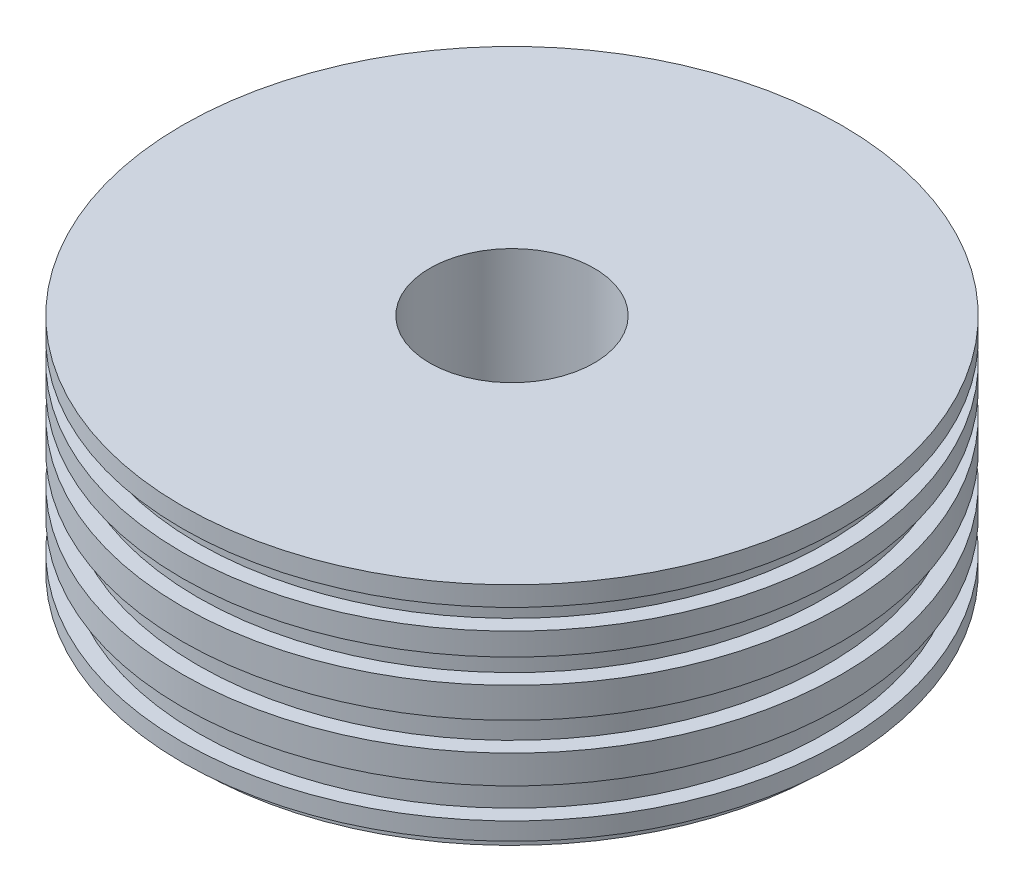
ISO-10303-21;
HEADER;
FILE_DESCRIPTION(('STEP AP214'),'2;1');
FILE_NAME('part.step','',(''),(''),'','','');
FILE_SCHEMA(('AUTOMOTIVE_DESIGN { 1 0 10303 214 1 1 1 1 }'));
ENDSEC;
DATA;
#1=APPLICATION_CONTEXT('core data for automotive mechanical design processes');
#2=APPLICATION_PROTOCOL_DEFINITION('international standard','automotive_design',2000,#1);
#3=PRODUCT_CONTEXT('',#1,'mechanical');
#4=PRODUCT('Part','Part','',(#3));
#5=PRODUCT_RELATED_PRODUCT_CATEGORY('part','',(#4));
#6=PRODUCT_DEFINITION_FORMATION('','',#4);
#7=PRODUCT_DEFINITION_CONTEXT('part definition',#1,'design');
#8=PRODUCT_DEFINITION('design','',#6,#7);
#9=PRODUCT_DEFINITION_SHAPE('','',#8);
#10=(LENGTH_UNIT() NAMED_UNIT(*) SI_UNIT(.MILLI.,.METRE.));
#11=(NAMED_UNIT(*) PLANE_ANGLE_UNIT() SI_UNIT($,.RADIAN.));
#12=(NAMED_UNIT(*) SI_UNIT($,.STERADIAN.) SOLID_ANGLE_UNIT());
#13=UNCERTAINTY_MEASURE_WITH_UNIT(LENGTH_MEASURE(1.E-05),#10,'distance_accuracy_value','');
#14=(GEOMETRIC_REPRESENTATION_CONTEXT(3) GLOBAL_UNCERTAINTY_ASSIGNED_CONTEXT((#13)) GLOBAL_UNIT_ASSIGNED_CONTEXT((#10,
#11,#12)) REPRESENTATION_CONTEXT('',''));
#15=CARTESIAN_POINT('',(0.,0.,0.));
#16=DIRECTION('',(0.,0.,1.));
#17=DIRECTION('',(1.,0.,0.));
#18=AXIS2_PLACEMENT_3D('',#15,#16,#17);
#19=CARTESIAN_POINT('',(0.,53.5469233178621,0.));
#20=DIRECTION('',(0.,1.,0.));
#21=DIRECTION('',(0.,0.,1.));
#22=AXIS2_PLACEMENT_3D('',#19,#20,#21);
#23=CYLINDRICAL_SURFACE('',#22,40.3402830376719);
#24=CARTESIAN_POINT('',(0.,-53.0666818531279,0.));
#25=DIRECTION('',(0.,1.,0.));
#26=DIRECTION('',(0.,0.,1.));
#27=AXIS2_PLACEMENT_3D('',#24,#25,#26);
#28=CIRCLE('',#27,40.3402830376719);
#29=CARTESIAN_POINT('',(0.,-53.0666818531279,40.3402830376719));
#30=VERTEX_POINT('',#29);
#31=EDGE_CURVE('E10',#30,#30,#28,.T.);
#32=ORIENTED_EDGE('',*,*,#31,.F.);
#33=EDGE_LOOP('',(#32));
#34=FACE_BOUND('',#33,.T.);
#35=CARTESIAN_POINT('',(0.,63.1517526125459,0.));
#36=DIRECTION('',(0.,1.,0.));
#37=DIRECTION('',(0.,0.,1.));
#38=AXIS2_PLACEMENT_3D('',#35,#36,#37);
#39=CIRCLE('',#38,40.3402830376719);
#40=CARTESIAN_POINT('',(0.,63.1517526125459,40.3402830376719));
#41=VERTEX_POINT('',#40);
#42=EDGE_CURVE('E101',#41,#41,#39,.T.);
#43=ORIENTED_EDGE('',*,*,#42,.T.);
#44=EDGE_LOOP('',(#43));
#45=FACE_BOUND('',#44,.T.);
#46=ADVANCED_FACE('F31',(#34,#45),#23,.F.);
#47=CARTESIAN_POINT('',(40.3402830376719,-53.0666818531279,0.));
#48=DIRECTION('',(0.,1.,0.));
#49=DIRECTION('',(0.,0.,1.));
#50=AXIS2_PLACEMENT_3D('',#47,#48,#49);
#51=PLANE('',#50);
#52=CARTESIAN_POINT('',(0.,-53.0666818531279,0.));
#53=DIRECTION('',(0.,1.,0.));
#54=DIRECTION('',(0.,0.,1.));
#55=AXIS2_PLACEMENT_3D('',#52,#53,#54);
#56=CIRCLE('',#55,154.157510179675);
#57=CARTESIAN_POINT('',(0.,-53.0666818531279,154.157510179675));
#58=VERTEX_POINT('',#57);
#59=EDGE_CURVE('E37',#58,#58,#56,.T.);
#60=ORIENTED_EDGE('',*,*,#59,.F.);
#61=EDGE_LOOP('',(#60));
#62=FACE_BOUND('',#61,.T.);
#63=ORIENTED_EDGE('',*,*,#31,.T.);
#64=EDGE_LOOP('',(#63));
#65=FACE_BOUND('',#64,.T.);
#66=ADVANCED_FACE('F222',(#62,#65),#51,.F.);
#67=CARTESIAN_POINT('',(0.,53.5469233178621,0.));
#68=DIRECTION('',(0.,1.,0.));
#69=DIRECTION('',(0.,0.,1.));
#70=AXIS2_PLACEMENT_3D('',#67,#68,#69);
#71=CYLINDRICAL_SURFACE('',#70,154.157510179675);
#72=CARTESIAN_POINT('',(0.,-45.8630598821151,0.));
#73=DIRECTION('',(0.,1.,0.));
#74=DIRECTION('',(0.,0.,1.));
#75=AXIS2_PLACEMENT_3D('',#72,#73,#74);
#76=CIRCLE('',#75,154.157510179675);
#77=CARTESIAN_POINT('',(0.,-45.8630598821151,154.157510179675));
#78=VERTEX_POINT('',#77);
#79=EDGE_CURVE('E41',#78,#78,#76,.T.);
#80=ORIENTED_EDGE('',*,*,#79,.F.);
#81=EDGE_LOOP('',(#80));
#82=FACE_BOUND('',#81,.T.);
#83=ORIENTED_EDGE('',*,*,#59,.T.);
#84=EDGE_LOOP('',(#83));
#85=FACE_BOUND('',#84,.T.);
#86=ADVANCED_FACE('F217',(#82,#85),#71,.T.);
#87=CARTESIAN_POINT('',(154.157510179675,-45.8630598821151,0.));
#88=DIRECTION('',(0.,1.,0.));
#89=DIRECTION('',(0.,0.,1.));
#90=AXIS2_PLACEMENT_3D('',#87,#88,#89);
#91=PLANE('',#90);
#92=CARTESIAN_POINT('',(0.,-45.8630598821151,0.));
#93=DIRECTION('',(0.,1.,0.));
#94=DIRECTION('',(0.,0.,1.));
#95=AXIS2_PLACEMENT_3D('',#92,#93,#94);
#96=CIRCLE('',#95,161.841373615422);
#97=CARTESIAN_POINT('',(0.,-45.8630598821151,161.841373615422));
#98=VERTEX_POINT('',#97);
#99=EDGE_CURVE('E45',#98,#98,#96,.T.);
#100=ORIENTED_EDGE('',*,*,#99,.F.);
#101=EDGE_LOOP('',(#100));
#102=FACE_BOUND('',#101,.T.);
#103=ORIENTED_EDGE('',*,*,#79,.T.);
#104=EDGE_LOOP('',(#103));
#105=FACE_BOUND('',#104,.T.);
#106=ADVANCED_FACE('F211',(#102,#105),#91,.F.);
#107=CARTESIAN_POINT('',(0.,53.5469233178621,0.));
#108=DIRECTION('',(0.,1.,0.));
#109=DIRECTION('',(0.,0.,1.));
#110=AXIS2_PLACEMENT_3D('',#107,#108,#109);
#111=CYLINDRICAL_SURFACE('',#110,161.841373615422);
#112=CARTESIAN_POINT('',(0.,-37.2187135168997,0.));
#113=DIRECTION('',(0.,1.,0.));
#114=DIRECTION('',(0.,0.,1.));
#115=AXIS2_PLACEMENT_3D('',#112,#113,#114);
#116=CIRCLE('',#115,161.841373615422);
#117=CARTESIAN_POINT('',(0.,-37.2187135168997,161.841373615422));
#118=VERTEX_POINT('',#117);
#119=EDGE_CURVE('E50',#118,#118,#116,.T.);
#120=ORIENTED_EDGE('',*,*,#119,.F.);
#121=EDGE_LOOP('',(#120));
#122=FACE_BOUND('',#121,.T.);
#123=ORIENTED_EDGE('',*,*,#99,.T.);
#124=EDGE_LOOP('',(#123));
#125=FACE_BOUND('',#124,.T.);
#126=ADVANCED_FACE('F205',(#122,#125),#111,.T.);
#127=CARTESIAN_POINT('',(161.841373615422,-37.2187135168997,0.));
#128=DIRECTION('',(0.,-1.,0.));
#129=DIRECTION('',(0.,0.,-1.));
#130=AXIS2_PLACEMENT_3D('',#127,#128,#129);
#131=PLANE('',#130);
#132=CARTESIAN_POINT('',(0.,-37.2187135168997,0.));
#133=DIRECTION('',(0.,1.,0.));
#134=DIRECTION('',(0.,0.,1.));
#135=AXIS2_PLACEMENT_3D('',#132,#133,#134);
#136=CIRCLE('',#135,154.157510179675);
#137=CARTESIAN_POINT('',(0.,-37.2187135168997,154.157510179675));
#138=VERTEX_POINT('',#137);
#139=EDGE_CURVE('E53',#138,#138,#136,.T.);
#140=ORIENTED_EDGE('',*,*,#139,.F.);
#141=EDGE_LOOP('',(#140));
#142=FACE_BOUND('',#141,.T.);
#143=ORIENTED_EDGE('',*,*,#119,.T.);
#144=EDGE_LOOP('',(#143));
#145=FACE_BOUND('',#144,.T.);
#146=ADVANCED_FACE('F199',(#142,#145),#131,.F.);
#147=CARTESIAN_POINT('',(0.,53.5469233178621,0.));
#148=DIRECTION('',(0.,1.,0.));
#149=DIRECTION('',(0.,0.,1.));
#150=AXIS2_PLACEMENT_3D('',#147,#148,#149);
#151=CYLINDRICAL_SURFACE('',#150,154.157510179675);
#152=CARTESIAN_POINT('',(0.,-22.3312281101398,0.));
#153=DIRECTION('',(0.,1.,0.));
#154=DIRECTION('',(0.,0.,1.));
#155=AXIS2_PLACEMENT_3D('',#152,#153,#154);
#156=CIRCLE('',#155,154.157510179675);
#157=CARTESIAN_POINT('',(0.,-22.3312281101398,154.157510179675));
#158=VERTEX_POINT('',#157);
#159=EDGE_CURVE('E56',#158,#158,#156,.T.);
#160=ORIENTED_EDGE('',*,*,#159,.F.);
#161=EDGE_LOOP('',(#160));
#162=FACE_BOUND('',#161,.T.);
#163=ORIENTED_EDGE('',*,*,#139,.T.);
#164=EDGE_LOOP('',(#163));
#165=FACE_BOUND('',#164,.T.);
#166=ADVANCED_FACE('F193',(#162,#165),#151,.T.);
#167=CARTESIAN_POINT('',(154.157510179675,-22.3312281101398,0.));
#168=DIRECTION('',(0.,1.,0.));
#169=DIRECTION('',(0.,0.,1.));
#170=AXIS2_PLACEMENT_3D('',#167,#168,#169);
#171=PLANE('',#170);
#172=CARTESIAN_POINT('',(0.,-22.3312281101398,0.));
#173=DIRECTION('',(0.,1.,0.));
#174=DIRECTION('',(0.,0.,1.));
#175=AXIS2_PLACEMENT_3D('',#172,#173,#174);
#176=CIRCLE('',#175,161.841373615422);
#177=CARTESIAN_POINT('',(0.,-22.3312281101398,161.841373615422));
#178=VERTEX_POINT('',#177);
#179=EDGE_CURVE('E59',#178,#178,#176,.T.);
#180=ORIENTED_EDGE('',*,*,#179,.F.);
#181=EDGE_LOOP('',(#180));
#182=FACE_BOUND('',#181,.T.);
#183=ORIENTED_EDGE('',*,*,#159,.T.);
#184=EDGE_LOOP('',(#183));
#185=FACE_BOUND('',#184,.T.);
#186=ADVANCED_FACE('F187',(#182,#185),#171,.F.);
#187=CARTESIAN_POINT('',(0.,53.5469233178621,0.));
#188=DIRECTION('',(0.,1.,0.));
#189=DIRECTION('',(0.,0.,1.));
#190=AXIS2_PLACEMENT_3D('',#187,#188,#189);
#191=CYLINDRICAL_SURFACE('',#190,161.841373615422);
#192=CARTESIAN_POINT('',(0.,-8.40422563284832,0.));
#193=DIRECTION('',(0.,1.,0.));
#194=DIRECTION('',(0.,0.,1.));
#195=AXIS2_PLACEMENT_3D('',#192,#193,#194);
#196=CIRCLE('',#195,161.841373615422);
#197=CARTESIAN_POINT('',(0.,-8.40422563284832,161.841373615422));
#198=VERTEX_POINT('',#197);
#199=EDGE_CURVE('E62',#198,#198,#196,.T.);
#200=ORIENTED_EDGE('',*,*,#199,.F.);
#201=EDGE_LOOP('',(#200));
#202=FACE_BOUND('',#201,.T.);
#203=ORIENTED_EDGE('',*,*,#179,.T.);
#204=EDGE_LOOP('',(#203));
#205=FACE_BOUND('',#204,.T.);
#206=ADVANCED_FACE('F181',(#202,#205),#191,.T.);
#207=CARTESIAN_POINT('',(161.841373615422,-8.40422563284832,0.));
#208=DIRECTION('',(0.,-1.,0.));
#209=DIRECTION('',(0.,0.,-1.));
#210=AXIS2_PLACEMENT_3D('',#207,#208,#209);
#211=PLANE('',#210);
#212=CARTESIAN_POINT('',(0.,-8.40422563284832,0.));
#213=DIRECTION('',(0.,1.,0.));
#214=DIRECTION('',(0.,0.,1.));
#215=AXIS2_PLACEMENT_3D('',#212,#213,#214);
#216=CIRCLE('',#215,154.157510179675);
#217=CARTESIAN_POINT('',(0.,-8.40422563284832,154.157510179675));
#218=VERTEX_POINT('',#217);
#219=EDGE_CURVE('E65',#218,#218,#216,.T.);
#220=ORIENTED_EDGE('',*,*,#219,.F.);
#221=EDGE_LOOP('',(#220));
#222=FACE_BOUND('',#221,.T.);
#223=ORIENTED_EDGE('',*,*,#199,.T.);
#224=EDGE_LOOP('',(#223));
#225=FACE_BOUND('',#224,.T.);
#226=ADVANCED_FACE('F175',(#222,#225),#211,.F.);
#227=CARTESIAN_POINT('',(0.,53.5469233178621,0.));
#228=DIRECTION('',(0.,1.,0.));
#229=DIRECTION('',(0.,0.,1.));
#230=AXIS2_PLACEMENT_3D('',#227,#228,#229);
#231=CYLINDRICAL_SURFACE('',#230,154.157510179675);
#232=CARTESIAN_POINT('',(0.,5.52277684444318,0.));
#233=DIRECTION('',(0.,1.,0.));
#234=DIRECTION('',(0.,0.,1.));
#235=AXIS2_PLACEMENT_3D('',#232,#233,#234);
#236=CIRCLE('',#235,154.157510179675);
#237=CARTESIAN_POINT('',(0.,5.52277684444318,154.157510179675));
#238=VERTEX_POINT('',#237);
#239=EDGE_CURVE('E68',#238,#238,#236,.T.);
#240=ORIENTED_EDGE('',*,*,#239,.F.);
#241=EDGE_LOOP('',(#240));
#242=FACE_BOUND('',#241,.T.);
#243=ORIENTED_EDGE('',*,*,#219,.T.);
#244=EDGE_LOOP('',(#243));
#245=FACE_BOUND('',#244,.T.);
#246=ADVANCED_FACE('F169',(#242,#245),#231,.T.);
#247=CARTESIAN_POINT('',(154.157510179675,5.52277684444318,0.));
#248=DIRECTION('',(0.,1.,0.));
#249=DIRECTION('',(0.,0.,1.));
#250=AXIS2_PLACEMENT_3D('',#247,#248,#249);
#251=PLANE('',#250);
#252=CARTESIAN_POINT('',(0.,5.52277684444318,0.));
#253=DIRECTION('',(0.,1.,0.));
#254=DIRECTION('',(0.,0.,1.));
#255=AXIS2_PLACEMENT_3D('',#252,#253,#254);
#256=CIRCLE('',#255,161.841373615422);
#257=CARTESIAN_POINT('',(0.,5.52277684444318,161.841373615422));
#258=VERTEX_POINT('',#257);
#259=EDGE_CURVE('E71',#258,#258,#256,.T.);
#260=ORIENTED_EDGE('',*,*,#259,.F.);
#261=EDGE_LOOP('',(#260));
#262=FACE_BOUND('',#261,.T.);
#263=ORIENTED_EDGE('',*,*,#239,.T.);
#264=EDGE_LOOP('',(#263));
#265=FACE_BOUND('',#264,.T.);
#266=ADVANCED_FACE('F163',(#262,#265),#251,.F.);
#267=CARTESIAN_POINT('',(0.,53.5469233178621,0.));
#268=DIRECTION('',(0.,1.,0.));
#269=DIRECTION('',(0.,0.,1.));
#270=AXIS2_PLACEMENT_3D('',#267,#268,#269);
#271=CYLINDRICAL_SURFACE('',#270,161.841373615422);
#272=CARTESIAN_POINT('',(0.,20.4102622512031,0.));
#273=DIRECTION('',(0.,1.,0.));
#274=DIRECTION('',(0.,0.,1.));
#275=AXIS2_PLACEMENT_3D('',#272,#273,#274);
#276=CIRCLE('',#275,161.841373615422);
#277=CARTESIAN_POINT('',(0.,20.4102622512031,161.841373615422));
#278=VERTEX_POINT('',#277);
#279=EDGE_CURVE('E74',#278,#278,#276,.T.);
#280=ORIENTED_EDGE('',*,*,#279,.F.);
#281=EDGE_LOOP('',(#280));
#282=FACE_BOUND('',#281,.T.);
#283=ORIENTED_EDGE('',*,*,#259,.T.);
#284=EDGE_LOOP('',(#283));
#285=FACE_BOUND('',#284,.T.);
#286=ADVANCED_FACE('F157',(#282,#285),#271,.T.);
#287=CARTESIAN_POINT('',(161.841373615422,20.4102622512031,0.));
#288=DIRECTION('',(0.,-1.,0.));
#289=DIRECTION('',(0.,0.,-1.));
#290=AXIS2_PLACEMENT_3D('',#287,#288,#289);
#291=PLANE('',#290);
#292=CARTESIAN_POINT('',(0.,20.4102622512031,0.));
#293=DIRECTION('',(0.,1.,0.));
#294=DIRECTION('',(0.,0.,1.));
#295=AXIS2_PLACEMENT_3D('',#292,#293,#294);
#296=CIRCLE('',#295,154.157510179675);
#297=CARTESIAN_POINT('',(0.,20.4102622512031,154.157510179675));
#298=VERTEX_POINT('',#297);
#299=EDGE_CURVE('E77',#298,#298,#296,.T.);
#300=ORIENTED_EDGE('',*,*,#299,.F.);
#301=EDGE_LOOP('',(#300));
#302=FACE_BOUND('',#301,.T.);
#303=ORIENTED_EDGE('',*,*,#279,.T.);
#304=EDGE_LOOP('',(#303));
#305=FACE_BOUND('',#304,.T.);
#306=ADVANCED_FACE('F151',(#302,#305),#291,.F.);
#307=CARTESIAN_POINT('',(0.,53.5469233178621,0.));
#308=DIRECTION('',(0.,1.,0.));
#309=DIRECTION('',(0.,0.,1.));
#310=AXIS2_PLACEMENT_3D('',#307,#308,#309);
#311=CYLINDRICAL_SURFACE('',#310,154.157510179675);
#312=CARTESIAN_POINT('',(0.,32.4162988695578,0.));
#313=DIRECTION('',(0.,1.,0.));
#314=DIRECTION('',(0.,0.,1.));
#315=AXIS2_PLACEMENT_3D('',#312,#313,#314);
#316=CIRCLE('',#315,154.157510179675);
#317=CARTESIAN_POINT('',(0.,32.4162988695578,154.157510179675));
#318=VERTEX_POINT('',#317);
#319=EDGE_CURVE('E80',#318,#318,#316,.T.);
#320=ORIENTED_EDGE('',*,*,#319,.F.);
#321=EDGE_LOOP('',(#320));
#322=FACE_BOUND('',#321,.T.);
#323=ORIENTED_EDGE('',*,*,#299,.T.);
#324=EDGE_LOOP('',(#323));
#325=FACE_BOUND('',#324,.T.);
#326=ADVANCED_FACE('F145',(#322,#325),#311,.T.);
#327=CARTESIAN_POINT('',(154.157510179675,32.4162988695578,0.));
#328=DIRECTION('',(0.,1.,0.));
#329=DIRECTION('',(0.,0.,1.));
#330=AXIS2_PLACEMENT_3D('',#327,#328,#329);
#331=PLANE('',#330);
#332=CARTESIAN_POINT('',(0.,32.4162988695578,0.));
#333=DIRECTION('',(0.,1.,0.));
#334=DIRECTION('',(0.,0.,1.));
#335=AXIS2_PLACEMENT_3D('',#332,#333,#334);
#336=CIRCLE('',#335,161.841373615422);
#337=CARTESIAN_POINT('',(0.,32.4162988695578,161.841373615422));
#338=VERTEX_POINT('',#337);
#339=EDGE_CURVE('E83',#338,#338,#336,.T.);
#340=ORIENTED_EDGE('',*,*,#339,.F.);
#341=EDGE_LOOP('',(#340));
#342=FACE_BOUND('',#341,.T.);
#343=ORIENTED_EDGE('',*,*,#319,.T.);
#344=EDGE_LOOP('',(#343));
#345=FACE_BOUND('',#344,.T.);
#346=ADVANCED_FACE('F139',(#342,#345),#331,.F.);
#347=CARTESIAN_POINT('',(0.,53.5469233178621,0.));
#348=DIRECTION('',(0.,1.,0.));
#349=DIRECTION('',(0.,0.,1.));
#350=AXIS2_PLACEMENT_3D('',#347,#348,#349);
#351=CYLINDRICAL_SURFACE('',#350,161.841373615422);
#352=CARTESIAN_POINT('',(0.,43.4618525584441,0.));
#353=DIRECTION('',(0.,1.,0.));
#354=DIRECTION('',(0.,0.,1.));
#355=AXIS2_PLACEMENT_3D('',#352,#353,#354);
#356=CIRCLE('',#355,161.841373615422);
#357=CARTESIAN_POINT('',(0.,43.4618525584441,161.841373615422));
#358=VERTEX_POINT('',#357);
#359=EDGE_CURVE('E86',#358,#358,#356,.T.);
#360=ORIENTED_EDGE('',*,*,#359,.F.);
#361=EDGE_LOOP('',(#360));
#362=FACE_BOUND('',#361,.T.);
#363=ORIENTED_EDGE('',*,*,#339,.T.);
#364=EDGE_LOOP('',(#363));
#365=FACE_BOUND('',#364,.T.);
#366=ADVANCED_FACE('F133',(#362,#365),#351,.T.);
#367=CARTESIAN_POINT('',(161.841373615422,43.4618525584441,0.));
#368=DIRECTION('',(0.,-1.,0.));
#369=DIRECTION('',(0.,0.,-1.));
#370=AXIS2_PLACEMENT_3D('',#367,#368,#369);
#371=PLANE('',#370);
#372=CARTESIAN_POINT('',(0.,43.4618525584441,0.));
#373=DIRECTION('',(0.,1.,0.));
#374=DIRECTION('',(0.,0.,1.));
#375=AXIS2_PLACEMENT_3D('',#372,#373,#374);
#376=CIRCLE('',#375,154.157510179675);
#377=CARTESIAN_POINT('',(0.,43.4618525584441,154.157510179675));
#378=VERTEX_POINT('',#377);
#379=EDGE_CURVE('E89',#378,#378,#376,.T.);
#380=ORIENTED_EDGE('',*,*,#379,.F.);
#381=EDGE_LOOP('',(#380));
#382=FACE_BOUND('',#381,.T.);
#383=ORIENTED_EDGE('',*,*,#359,.T.);
#384=EDGE_LOOP('',(#383));
#385=FACE_BOUND('',#384,.T.);
#386=ADVANCED_FACE('F127',(#382,#385),#371,.F.);
#387=CARTESIAN_POINT('',(0.,53.5469233178621,0.));
#388=DIRECTION('',(0.,1.,0.));
#389=DIRECTION('',(0.,0.,1.));
#390=AXIS2_PLACEMENT_3D('',#387,#388,#389);
#391=CYLINDRICAL_SURFACE('',#390,154.157510179675);
#392=CARTESIAN_POINT('',(0.,53.5469233178621,0.));
#393=DIRECTION('',(0.,1.,0.));
#394=DIRECTION('',(0.,0.,1.));
#395=AXIS2_PLACEMENT_3D('',#392,#393,#394);
#396=CIRCLE('',#395,154.157510179675);
#397=CARTESIAN_POINT('',(0.,53.5469233178621,154.157510179675));
#398=VERTEX_POINT('',#397);
#399=EDGE_CURVE('E92',#398,#398,#396,.T.);
#400=ORIENTED_EDGE('',*,*,#399,.F.);
#401=EDGE_LOOP('',(#400));
#402=FACE_BOUND('',#401,.T.);
#403=ORIENTED_EDGE('',*,*,#379,.T.);
#404=EDGE_LOOP('',(#403));
#405=FACE_BOUND('',#404,.T.);
#406=ADVANCED_FACE('F121',(#402,#405),#391,.T.);
#407=CARTESIAN_POINT('',(154.157510179675,53.5469233178621,0.));
#408=DIRECTION('',(0.,1.,0.));
#409=DIRECTION('',(0.,0.,1.));
#410=AXIS2_PLACEMENT_3D('',#407,#408,#409);
#411=PLANE('',#410);
#412=CARTESIAN_POINT('',(0.,53.5469233178621,0.));
#413=DIRECTION('',(0.,1.,0.));
#414=DIRECTION('',(0.,0.,1.));
#415=AXIS2_PLACEMENT_3D('',#412,#413,#414);
#416=CIRCLE('',#415,161.841373615422);
#417=CARTESIAN_POINT('',(0.,53.5469233178621,161.841373615422));
#418=VERTEX_POINT('',#417);
#419=EDGE_CURVE('E95',#418,#418,#416,.T.);
#420=ORIENTED_EDGE('',*,*,#419,.F.);
#421=EDGE_LOOP('',(#420));
#422=FACE_BOUND('',#421,.T.);
#423=ORIENTED_EDGE('',*,*,#399,.T.);
#424=EDGE_LOOP('',(#423));
#425=FACE_BOUND('',#424,.T.);
#426=ADVANCED_FACE('F115',(#422,#425),#411,.F.);
#427=CARTESIAN_POINT('',(0.,53.5469233178621,0.));
#428=DIRECTION('',(0.,1.,0.));
#429=DIRECTION('',(0.,0.,1.));
#430=AXIS2_PLACEMENT_3D('',#427,#428,#429);
#431=CYLINDRICAL_SURFACE('',#430,161.841373615422);
#432=CARTESIAN_POINT('',(0.,63.1517526125459,0.));
#433=DIRECTION('',(0.,1.,0.));
#434=DIRECTION('',(0.,0.,1.));
#435=AXIS2_PLACEMENT_3D('',#432,#433,#434);
#436=CIRCLE('',#435,161.841373615422);
#437=CARTESIAN_POINT('',(0.,63.1517526125459,161.841373615422));
#438=VERTEX_POINT('',#437);
#439=EDGE_CURVE('E98',#438,#438,#436,.T.);
#440=ORIENTED_EDGE('',*,*,#439,.F.);
#441=EDGE_LOOP('',(#440));
#442=FACE_BOUND('',#441,.T.);
#443=ORIENTED_EDGE('',*,*,#419,.T.);
#444=EDGE_LOOP('',(#443));
#445=FACE_BOUND('',#444,.T.);
#446=ADVANCED_FACE('F109',(#442,#445),#431,.T.);
#447=CARTESIAN_POINT('',(161.841373615422,63.1517526125459,0.));
#448=DIRECTION('',(0.,-1.,0.));
#449=DIRECTION('',(0.,0.,-1.));
#450=AXIS2_PLACEMENT_3D('',#447,#448,#449);
#451=PLANE('',#450);
#452=ORIENTED_EDGE('',*,*,#42,.F.);
#453=EDGE_LOOP('',(#452));
#454=FACE_BOUND('',#453,.T.);
#455=ORIENTED_EDGE('',*,*,#439,.T.);
#456=EDGE_LOOP('',(#455));
#457=FACE_BOUND('',#456,.T.);
#458=ADVANCED_FACE('F106',(#454,#457),#451,.F.);
#459=CLOSED_SHELL('',(#46,#66,#86,#106,#126,#146,#166,#186,#206,#226,#246,#266,#286,#306,#326,
#346,#366,#386,#406,#426,#446,#458));
#460=MANIFOLD_SOLID_BREP('B2',#459);
#461=ADVANCED_BREP_SHAPE_REPRESENTATION('',(#18,#460),#14);
#462=SHAPE_DEFINITION_REPRESENTATION(#9,#461);
ENDSEC;
END-ISO-10303-21;
